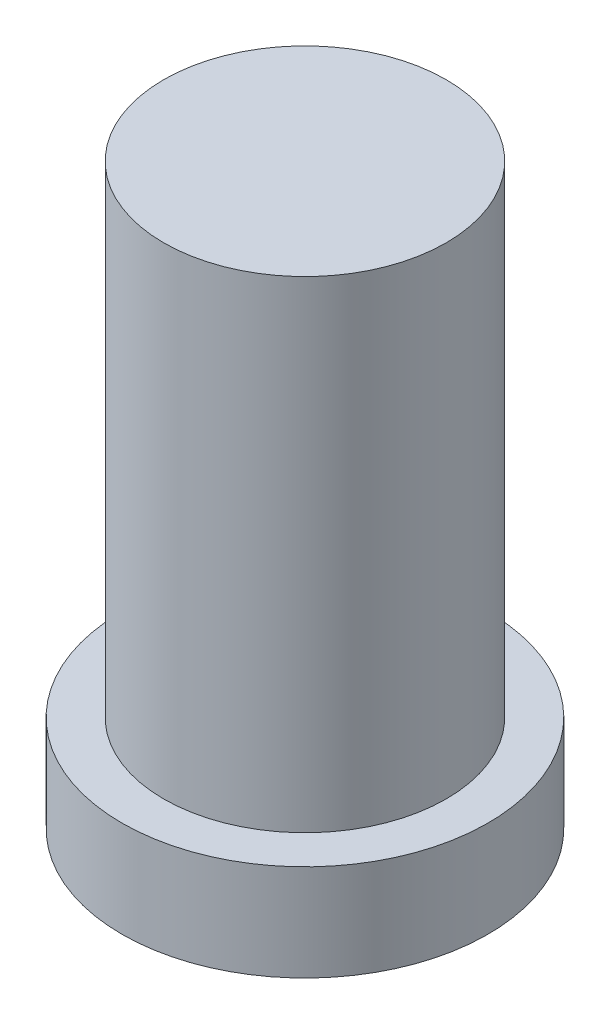
ISO-10303-21;
HEADER;
FILE_DESCRIPTION(('STEP AP214'),'2;1');
FILE_NAME('part.step','',(''),(''),'','','');
FILE_SCHEMA(('AUTOMOTIVE_DESIGN { 1 0 10303 214 1 1 1 1 }'));
ENDSEC;
DATA;
#1=APPLICATION_CONTEXT('core data for automotive mechanical design processes');
#2=APPLICATION_PROTOCOL_DEFINITION('international standard','automotive_design',2000,#1);
#3=PRODUCT_CONTEXT('',#1,'mechanical');
#4=PRODUCT('Part','Part','',(#3));
#5=PRODUCT_RELATED_PRODUCT_CATEGORY('part','',(#4));
#6=PRODUCT_DEFINITION_FORMATION('','',#4);
#7=PRODUCT_DEFINITION_CONTEXT('part definition',#1,'design');
#8=PRODUCT_DEFINITION('design','',#6,#7);
#9=PRODUCT_DEFINITION_SHAPE('','',#8);
#10=(LENGTH_UNIT() NAMED_UNIT(*) SI_UNIT(.MILLI.,.METRE.));
#11=(NAMED_UNIT(*) PLANE_ANGLE_UNIT() SI_UNIT($,.RADIAN.));
#12=(NAMED_UNIT(*) SI_UNIT($,.STERADIAN.) SOLID_ANGLE_UNIT());
#13=UNCERTAINTY_MEASURE_WITH_UNIT(LENGTH_MEASURE(1.E-05),#10,'distance_accuracy_value','');
#14=(GEOMETRIC_REPRESENTATION_CONTEXT(3) GLOBAL_UNCERTAINTY_ASSIGNED_CONTEXT((#13)) GLOBAL_UNIT_ASSIGNED_CONTEXT((#10,
#11,#12)) REPRESENTATION_CONTEXT('',''));
#15=CARTESIAN_POINT('',(0.,0.,0.));
#16=DIRECTION('',(0.,0.,1.));
#17=DIRECTION('',(1.,0.,0.));
#18=AXIS2_PLACEMENT_3D('',#15,#16,#17);
#19=CARTESIAN_POINT('',(0.,15.,0.));
#20=DIRECTION('',(0.,-1.,0.));
#21=DIRECTION('',(0.,0.,-1.));
#22=AXIS2_PLACEMENT_3D('',#19,#20,#21);
#23=CYLINDRICAL_SURFACE('',#22,28.5);
#24=CARTESIAN_POINT('',(0.,15.,0.));
#25=DIRECTION('',(0.,1.,0.));
#26=DIRECTION('',(0.,0.,1.));
#27=AXIS2_PLACEMENT_3D('',#24,#25,#26);
#28=CIRCLE('',#27,28.5);
#29=CARTESIAN_POINT('',(0.,15.,28.5));
#30=VERTEX_POINT('',#29);
#31=EDGE_CURVE('E10',#30,#30,#28,.T.);
#32=ORIENTED_EDGE('',*,*,#31,.F.);
#33=EDGE_LOOP('',(#32));
#34=FACE_BOUND('',#33,.T.);
#35=CARTESIAN_POINT('',(0.,0.,0.));
#36=DIRECTION('',(0.,1.,0.));
#37=DIRECTION('',(0.,0.,1.));
#38=AXIS2_PLACEMENT_3D('',#35,#36,#37);
#39=CIRCLE('',#38,28.5);
#40=CARTESIAN_POINT('',(0.,0.,28.5));
#41=VERTEX_POINT('',#40);
#42=EDGE_CURVE('E36',#41,#41,#39,.T.);
#43=ORIENTED_EDGE('',*,*,#42,.T.);
#44=EDGE_LOOP('',(#43));
#45=FACE_BOUND('',#44,.T.);
#46=ADVANCED_FACE('F33',(#34,#45),#23,.T.);
#47=CARTESIAN_POINT('',(0.,15.,0.));
#48=DIRECTION('',(0.,1.,0.));
#49=DIRECTION('',(0.,0.,1.));
#50=AXIS2_PLACEMENT_3D('',#47,#48,#49);
#51=PLANE('',#50);
#52=CARTESIAN_POINT('',(0.,15.,0.));
#53=DIRECTION('',(0.,1.,0.));
#54=DIRECTION('',(0.,0.,1.));
#55=AXIS2_PLACEMENT_3D('',#52,#53,#54);
#56=CIRCLE('',#55,22.);
#57=CARTESIAN_POINT('',(0.,15.,22.));
#58=VERTEX_POINT('',#57);
#59=EDGE_CURVE('E45',#58,#58,#56,.T.);
#60=ORIENTED_EDGE('',*,*,#59,.F.);
#61=EDGE_LOOP('',(#60));
#62=FACE_BOUND('',#61,.T.);
#63=ORIENTED_EDGE('',*,*,#31,.T.);
#64=EDGE_LOOP('',(#63));
#65=FACE_BOUND('',#64,.T.);
#66=ADVANCED_FACE('F60',(#62,#65),#51,.T.);
#67=CARTESIAN_POINT('',(0.,0.,0.));
#68=DIRECTION('',(0.,1.,0.));
#69=DIRECTION('',(0.,0.,1.));
#70=AXIS2_PLACEMENT_3D('',#67,#68,#69);
#71=PLANE('',#70);
#72=ORIENTED_EDGE('',*,*,#42,.F.);
#73=EDGE_LOOP('',(#72));
#74=FACE_BOUND('',#73,.T.);
#75=ADVANCED_FACE('F56',(#74),#71,.F.);
#76=CARTESIAN_POINT('',(0.,90.,0.));
#77=DIRECTION('',(0.,-1.,0.));
#78=DIRECTION('',(0.,0.,-1.));
#79=AXIS2_PLACEMENT_3D('',#76,#77,#78);
#80=CYLINDRICAL_SURFACE('',#79,22.);
#81=CARTESIAN_POINT('',(0.,90.,0.));
#82=DIRECTION('',(0.,1.,0.));
#83=DIRECTION('',(0.,0.,1.));
#84=AXIS2_PLACEMENT_3D('',#81,#82,#83);
#85=CIRCLE('',#84,22.);
#86=CARTESIAN_POINT('',(0.,90.,22.));
#87=VERTEX_POINT('',#86);
#88=EDGE_CURVE('E43',#87,#87,#85,.T.);
#89=ORIENTED_EDGE('',*,*,#88,.F.);
#90=EDGE_LOOP('',(#89));
#91=FACE_BOUND('',#90,.T.);
#92=ORIENTED_EDGE('',*,*,#59,.T.);
#93=EDGE_LOOP('',(#92));
#94=FACE_BOUND('',#93,.T.);
#95=ADVANCED_FACE('F53',(#91,#94),#80,.T.);
#96=CARTESIAN_POINT('',(0.,90.,0.));
#97=DIRECTION('',(0.,1.,0.));
#98=DIRECTION('',(0.,0.,1.));
#99=AXIS2_PLACEMENT_3D('',#96,#97,#98);
#100=PLANE('',#99);
#101=ORIENTED_EDGE('',*,*,#88,.T.);
#102=EDGE_LOOP('',(#101));
#103=FACE_BOUND('',#102,.T.);
#104=ADVANCED_FACE('F51',(#103),#100,.T.);
#105=CLOSED_SHELL('',(#46,#66,#75,#95,#104));
#106=MANIFOLD_SOLID_BREP('B2',#105);
#107=ADVANCED_BREP_SHAPE_REPRESENTATION('',(#18,#106),#14);
#108=SHAPE_DEFINITION_REPRESENTATION(#9,#107);
ENDSEC;
END-ISO-10303-21;
